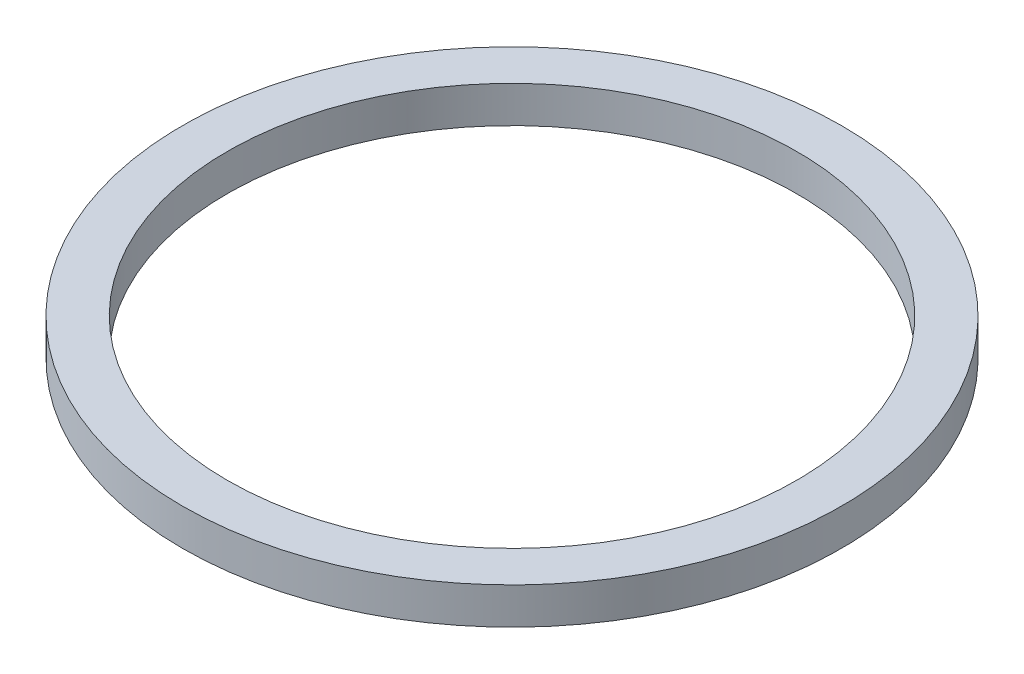
ISO-10303-21;
HEADER;
FILE_DESCRIPTION(('STEP AP214'),'2;1');
FILE_NAME('part.step','',(''),(''),'','','');
FILE_SCHEMA(('AUTOMOTIVE_DESIGN { 1 0 10303 214 1 1 1 1 }'));
ENDSEC;
DATA;
#1=APPLICATION_CONTEXT('core data for automotive mechanical design processes');
#2=APPLICATION_PROTOCOL_DEFINITION('international standard','automotive_design',2000,#1);
#3=PRODUCT_CONTEXT('',#1,'mechanical');
#4=PRODUCT('Part','Part','',(#3));
#5=PRODUCT_RELATED_PRODUCT_CATEGORY('part','',(#4));
#6=PRODUCT_DEFINITION_FORMATION('','',#4);
#7=PRODUCT_DEFINITION_CONTEXT('part definition',#1,'design');
#8=PRODUCT_DEFINITION('design','',#6,#7);
#9=PRODUCT_DEFINITION_SHAPE('','',#8);
#10=(LENGTH_UNIT() NAMED_UNIT(*) SI_UNIT(.MILLI.,.METRE.));
#11=(NAMED_UNIT(*) PLANE_ANGLE_UNIT() SI_UNIT($,.RADIAN.));
#12=(NAMED_UNIT(*) SI_UNIT($,.STERADIAN.) SOLID_ANGLE_UNIT());
#13=UNCERTAINTY_MEASURE_WITH_UNIT(LENGTH_MEASURE(1.E-05),#10,'distance_accuracy_value','');
#14=(GEOMETRIC_REPRESENTATION_CONTEXT(3) GLOBAL_UNCERTAINTY_ASSIGNED_CONTEXT((#13)) GLOBAL_UNIT_ASSIGNED_CONTEXT((#10,
#11,#12)) REPRESENTATION_CONTEXT('',''));
#15=CARTESIAN_POINT('',(0.,0.,0.));
#16=DIRECTION('',(0.,0.,1.));
#17=DIRECTION('',(1.,0.,0.));
#18=AXIS2_PLACEMENT_3D('',#15,#16,#17);
#19=CARTESIAN_POINT('',(0.,4.5,0.));
#20=DIRECTION('',(0.,-1.,0.));
#21=DIRECTION('',(0.,0.,-1.));
#22=AXIS2_PLACEMENT_3D('',#19,#20,#21);
#23=CYLINDRICAL_SURFACE('',#22,40.5);
#24=CARTESIAN_POINT('',(0.,4.5,0.));
#25=DIRECTION('',(0.,1.,0.));
#26=DIRECTION('',(0.,0.,1.));
#27=AXIS2_PLACEMENT_3D('',#24,#25,#26);
#28=CIRCLE('',#27,40.5);
#29=CARTESIAN_POINT('',(0.,4.5,40.5));
#30=VERTEX_POINT('',#29);
#31=EDGE_CURVE('E10',#30,#30,#28,.T.);
#32=ORIENTED_EDGE('',*,*,#31,.F.);
#33=EDGE_LOOP('',(#32));
#34=FACE_BOUND('',#33,.T.);
#35=CARTESIAN_POINT('',(0.,0.,0.));
#36=DIRECTION('',(0.,1.,0.));
#37=DIRECTION('',(0.,0.,1.));
#38=AXIS2_PLACEMENT_3D('',#35,#36,#37);
#39=CIRCLE('',#38,40.5);
#40=CARTESIAN_POINT('',(0.,0.,40.5));
#41=VERTEX_POINT('',#40);
#42=EDGE_CURVE('E33',#41,#41,#39,.T.);
#43=ORIENTED_EDGE('',*,*,#42,.T.);
#44=EDGE_LOOP('',(#43));
#45=FACE_BOUND('',#44,.T.);
#46=ADVANCED_FACE('F30',(#34,#45),#23,.T.);
#47=CARTESIAN_POINT('',(0.,4.5,0.));
#48=DIRECTION('',(0.,1.,0.));
#49=DIRECTION('',(0.,0.,1.));
#50=AXIS2_PLACEMENT_3D('',#47,#48,#49);
#51=PLANE('',#50);
#52=CARTESIAN_POINT('',(0.,4.5,0.));
#53=DIRECTION('',(0.,1.,0.));
#54=DIRECTION('',(0.,0.,1.));
#55=AXIS2_PLACEMENT_3D('',#52,#53,#54);
#56=CIRCLE('',#55,35.);
#57=CARTESIAN_POINT('',(0.,4.5,35.));
#58=VERTEX_POINT('',#57);
#59=EDGE_CURVE('E42',#58,#58,#56,.T.);
#60=ORIENTED_EDGE('',*,*,#59,.F.);
#61=EDGE_LOOP('',(#60));
#62=FACE_BOUND('',#61,.T.);
#63=ORIENTED_EDGE('',*,*,#31,.T.);
#64=EDGE_LOOP('',(#63));
#65=FACE_BOUND('',#64,.T.);
#66=ADVANCED_FACE('F57',(#62,#65),#51,.T.);
#67=CARTESIAN_POINT('',(0.,0.,0.));
#68=DIRECTION('',(0.,1.,0.));
#69=DIRECTION('',(0.,0.,1.));
#70=AXIS2_PLACEMENT_3D('',#67,#68,#69);
#71=PLANE('',#70);
#72=CARTESIAN_POINT('',(0.,0.,0.));
#73=DIRECTION('',(0.,1.,0.));
#74=DIRECTION('',(0.,0.,1.));
#75=AXIS2_PLACEMENT_3D('',#72,#73,#74);
#76=CIRCLE('',#75,35.);
#77=CARTESIAN_POINT('',(0.,0.,35.));
#78=VERTEX_POINT('',#77);
#79=EDGE_CURVE('E40',#78,#78,#76,.T.);
#80=ORIENTED_EDGE('',*,*,#79,.T.);
#81=EDGE_LOOP('',(#80));
#82=FACE_BOUND('',#81,.T.);
#83=ORIENTED_EDGE('',*,*,#42,.F.);
#84=EDGE_LOOP('',(#83));
#85=FACE_BOUND('',#84,.T.);
#86=ADVANCED_FACE('F48',(#82,#85),#71,.F.);
#87=CARTESIAN_POINT('',(0.,0.,0.));
#88=DIRECTION('',(0.,1.,0.));
#89=DIRECTION('',(0.,0.,1.));
#90=AXIS2_PLACEMENT_3D('',#87,#88,#89);
#91=CYLINDRICAL_SURFACE('',#90,35.);
#92=ORIENTED_EDGE('',*,*,#79,.F.);
#93=EDGE_LOOP('',(#92));
#94=FACE_BOUND('',#93,.T.);
#95=ORIENTED_EDGE('',*,*,#59,.T.);
#96=EDGE_LOOP('',(#95));
#97=FACE_BOUND('',#96,.T.);
#98=ADVANCED_FACE('F51',(#94,#97),#91,.F.);
#99=CLOSED_SHELL('',(#46,#66,#86,#98));
#100=MANIFOLD_SOLID_BREP('B2',#99);
#101=ADVANCED_BREP_SHAPE_REPRESENTATION('',(#18,#100),#14);
#102=SHAPE_DEFINITION_REPRESENTATION(#9,#101);
ENDSEC;
END-ISO-10303-21;
